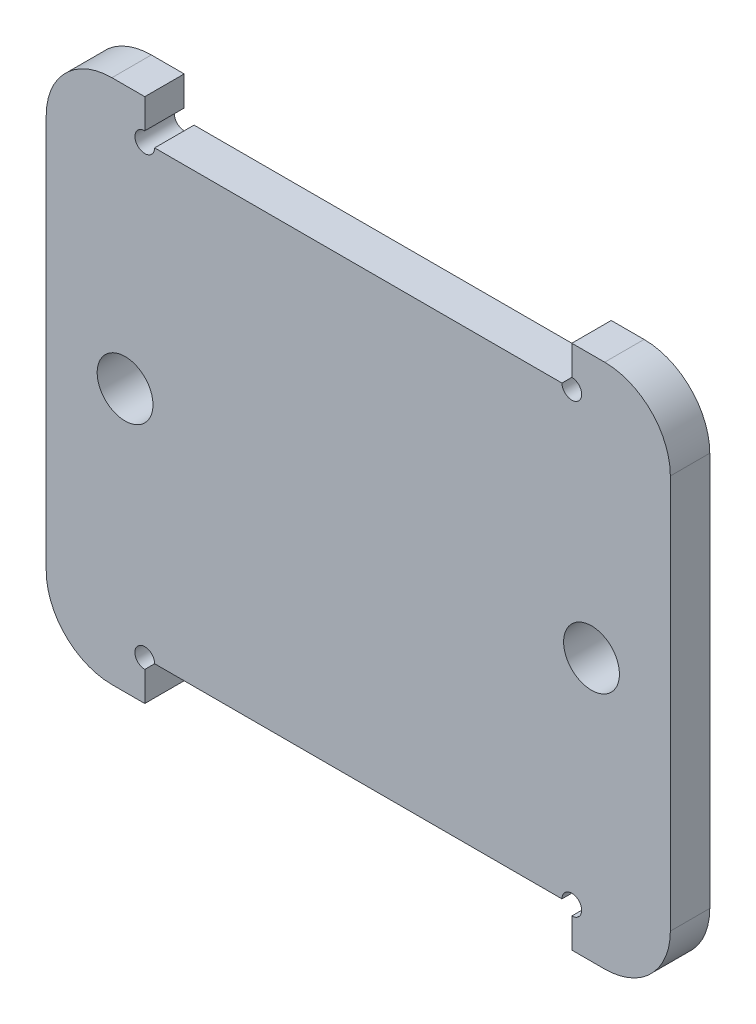
ISO-10303-21;
HEADER;
FILE_DESCRIPTION(('STEP AP214'),'2;1');
FILE_NAME('part.step','',(''),(''),'','','');
FILE_SCHEMA(('AUTOMOTIVE_DESIGN { 1 0 10303 214 1 1 1 1 }'));
ENDSEC;
DATA;
#1=APPLICATION_CONTEXT('core data for automotive mechanical design processes');
#2=APPLICATION_PROTOCOL_DEFINITION('international standard','automotive_design',2000,#1);
#3=PRODUCT_CONTEXT('',#1,'mechanical');
#4=PRODUCT('Part','Part','',(#3));
#5=PRODUCT_RELATED_PRODUCT_CATEGORY('part','',(#4));
#6=PRODUCT_DEFINITION_FORMATION('','',#4);
#7=PRODUCT_DEFINITION_CONTEXT('part definition',#1,'design');
#8=PRODUCT_DEFINITION('design','',#6,#7);
#9=PRODUCT_DEFINITION_SHAPE('','',#8);
#10=(LENGTH_UNIT() NAMED_UNIT(*) SI_UNIT(.MILLI.,.METRE.));
#11=(NAMED_UNIT(*) PLANE_ANGLE_UNIT() SI_UNIT($,.RADIAN.));
#12=(NAMED_UNIT(*) SI_UNIT($,.STERADIAN.) SOLID_ANGLE_UNIT());
#13=UNCERTAINTY_MEASURE_WITH_UNIT(LENGTH_MEASURE(1.E-05),#10,'distance_accuracy_value','');
#14=(GEOMETRIC_REPRESENTATION_CONTEXT(3) GLOBAL_UNCERTAINTY_ASSIGNED_CONTEXT((#13)) GLOBAL_UNIT_ASSIGNED_CONTEXT((#10,
#11,#12)) REPRESENTATION_CONTEXT('',''));
#15=CARTESIAN_POINT('',(0.,0.,0.));
#16=DIRECTION('',(0.,0.,1.));
#17=DIRECTION('',(1.,0.,0.));
#18=AXIS2_PLACEMENT_3D('',#15,#16,#17);
#19=CARTESIAN_POINT('',(-310.,90.,0.));
#20=DIRECTION('',(0.,0.,-1.));
#21=DIRECTION('',(-1.,0.,0.));
#22=AXIS2_PLACEMENT_3D('',#19,#20,#21);
#23=PLANE('',#22);
#24=CARTESIAN_POINT('',(-383.,60.,0.));
#25=DIRECTION('',(0.,0.,-1.));
#26=DIRECTION('',(-1.,0.,0.));
#27=AXIS2_PLACEMENT_3D('',#24,#25,#26);
#28=CIRCLE('',#27,4.24999999999998);
#29=CARTESIAN_POINT('',(-387.25,60.,0.));
#30=VERTEX_POINT('',#29);
#31=EDGE_CURVE('E161',#30,#30,#28,.F.);
#32=ORIENTED_EDGE('',*,*,#31,.T.);
#33=EDGE_LOOP('',(#32));
#34=FACE_BOUND('',#33,.T.);
#35=CARTESIAN_POINT('',(-312.,60.,0.));
#36=DIRECTION('',(0.,0.,-1.));
#37=DIRECTION('',(-1.,0.,0.));
#38=AXIS2_PLACEMENT_3D('',#35,#36,#37);
#39=CIRCLE('',#38,4.24999999999998);
#40=CARTESIAN_POINT('',(-316.25,60.,0.));
#41=VERTEX_POINT('',#40);
#42=EDGE_CURVE('E158',#41,#41,#39,.F.);
#43=ORIENTED_EDGE('',*,*,#42,.T.);
#44=EDGE_LOOP('',(#43));
#45=FACE_BOUND('',#44,.T.);
#46=DIRECTION('',(1.,0.,0.));
#47=VECTOR('',#46,1.);
#48=CARTESIAN_POINT('',(-310.,20.,0.));
#49=LINE('',#48,#47);
#50=CARTESIAN_POINT('',(-310.,20.,0.));
#51=VERTEX_POINT('',#50);
#52=CARTESIAN_POINT('',(-315.,20.,0.));
#53=VERTEX_POINT('',#52);
#54=EDGE_CURVE('E173',#51,#53,#49,.F.);
#55=ORIENTED_EDGE('',*,*,#54,.T.);
#56=DIRECTION('',(0.,1.,0.));
#57=VECTOR('',#56,1.);
#58=CARTESIAN_POINT('',(-315.,20.,0.));
#59=LINE('',#58,#57);
#60=CARTESIAN_POINT('',(-315.,24.4999999999999,0.));
#61=VERTEX_POINT('',#60);
#62=EDGE_CURVE('E167',#53,#61,#59,.T.);
#63=ORIENTED_EDGE('',*,*,#62,.T.);
#64=CARTESIAN_POINT('',(-315.,25.9999999999999,0.));
#65=DIRECTION('',(0.,0.,1.));
#66=DIRECTION('',(1.,0.,0.));
#67=AXIS2_PLACEMENT_3D('',#64,#65,#66);
#68=CIRCLE('',#67,1.5);
#69=CARTESIAN_POINT('',(-316.5,26.,0.));
#70=VERTEX_POINT('',#69);
#71=EDGE_CURVE('E154',#61,#70,#68,.T.);
#72=ORIENTED_EDGE('',*,*,#71,.T.);
#73=DIRECTION('',(-1.,0.,0.));
#74=VECTOR('',#73,1.);
#75=CARTESIAN_POINT('',(-315.,26.,0.));
#76=LINE('',#75,#74);
#77=CARTESIAN_POINT('',(-378.5,25.9999999999999,0.));
#78=VERTEX_POINT('',#77);
#79=EDGE_CURVE('E150',#70,#78,#76,.T.);
#80=ORIENTED_EDGE('',*,*,#79,.T.);
#81=CARTESIAN_POINT('',(-380.,25.9999999999999,0.));
#82=DIRECTION('',(0.,0.,1.));
#83=DIRECTION('',(1.,0.,0.));
#84=AXIS2_PLACEMENT_3D('',#81,#82,#83);
#85=CIRCLE('',#84,1.5);
#86=CARTESIAN_POINT('',(-380.,24.4999999999999,0.));
#87=VERTEX_POINT('',#86);
#88=EDGE_CURVE('E19',#78,#87,#85,.T.);
#89=ORIENTED_EDGE('',*,*,#88,.T.);
#90=DIRECTION('',(0.,1.,0.));
#91=VECTOR('',#90,1.);
#92=CARTESIAN_POINT('',(-380.,20.,0.));
#93=LINE('',#92,#91);
#94=CARTESIAN_POINT('',(-380.,20.,0.));
#95=VERTEX_POINT('',#94);
#96=EDGE_CURVE('E225',#87,#95,#93,.F.);
#97=ORIENTED_EDGE('',*,*,#96,.T.);
#98=DIRECTION('',(-1.,0.,0.));
#99=VECTOR('',#98,1.);
#100=CARTESIAN_POINT('',(-385.,20.,0.));
#101=LINE('',#100,#99);
#102=CARTESIAN_POINT('',(-385.,20.,0.));
#103=VERTEX_POINT('',#102);
#104=EDGE_CURVE('E218',#95,#103,#101,.T.);
#105=ORIENTED_EDGE('',*,*,#104,.T.);
#106=CARTESIAN_POINT('',(-385.,30.,0.));
#107=DIRECTION('',(0.,0.,-1.));
#108=DIRECTION('',(-1.,0.,0.));
#109=AXIS2_PLACEMENT_3D('',#106,#107,#108);
#110=CIRCLE('',#109,9.99999999999995);
#111=CARTESIAN_POINT('',(-395.,30.,0.));
#112=VERTEX_POINT('',#111);
#113=EDGE_CURVE('E221',#112,#103,#110,.F.);
#114=ORIENTED_EDGE('',*,*,#113,.F.);
#115=DIRECTION('',(0.,1.,0.));
#116=VECTOR('',#115,1.);
#117=CARTESIAN_POINT('',(-395.,90.,0.));
#118=LINE('',#117,#116);
#119=CARTESIAN_POINT('',(-395.,90.,0.));
#120=VERTEX_POINT('',#119);
#121=EDGE_CURVE('E213',#112,#120,#118,.T.);
#122=ORIENTED_EDGE('',*,*,#121,.T.);
#123=CARTESIAN_POINT('',(-385.,90.,0.));
#124=DIRECTION('',(0.,0.,-1.));
#125=DIRECTION('',(-1.,0.,0.));
#126=AXIS2_PLACEMENT_3D('',#123,#124,#125);
#127=CIRCLE('',#126,9.99999999999995);
#128=CARTESIAN_POINT('',(-385.,100.,0.));
#129=VERTEX_POINT('',#128);
#130=EDGE_CURVE('E216',#129,#120,#127,.F.);
#131=ORIENTED_EDGE('',*,*,#130,.F.);
#132=DIRECTION('',(1.,0.,0.));
#133=VECTOR('',#132,1.);
#134=CARTESIAN_POINT('',(-380.,100.,0.));
#135=LINE('',#134,#133);
#136=CARTESIAN_POINT('',(-380.,100.,0.));
#137=VERTEX_POINT('',#136);
#138=EDGE_CURVE('E207',#129,#137,#135,.T.);
#139=ORIENTED_EDGE('',*,*,#138,.T.);
#140=DIRECTION('',(0.,1.,0.));
#141=VECTOR('',#140,1.);
#142=CARTESIAN_POINT('',(-380.,94.,0.));
#143=LINE('',#142,#141);
#144=CARTESIAN_POINT('',(-380.,95.4999999999999,0.));
#145=VERTEX_POINT('',#144);
#146=EDGE_CURVE('E201',#137,#145,#143,.F.);
#147=ORIENTED_EDGE('',*,*,#146,.T.);
#148=CARTESIAN_POINT('',(-380.,93.9999999999999,0.));
#149=DIRECTION('',(0.,0.,1.));
#150=DIRECTION('',(1.,0.,0.));
#151=AXIS2_PLACEMENT_3D('',#148,#149,#150);
#152=CIRCLE('',#151,1.5);
#153=CARTESIAN_POINT('',(-378.5,94.,0.));
#154=VERTEX_POINT('',#153);
#155=EDGE_CURVE('E271',#145,#154,#152,.T.);
#156=ORIENTED_EDGE('',*,*,#155,.T.);
#157=DIRECTION('',(1.,0.,0.));
#158=VECTOR('',#157,1.);
#159=CARTESIAN_POINT('',(-380.,94.,0.));
#160=LINE('',#159,#158);
#161=CARTESIAN_POINT('',(-316.5,94.,0.));
#162=VERTEX_POINT('',#161);
#163=EDGE_CURVE('E196',#154,#162,#160,.T.);
#164=ORIENTED_EDGE('',*,*,#163,.T.);
#165=CARTESIAN_POINT('',(-315.,93.9999999999999,0.));
#166=DIRECTION('',(0.,0.,1.));
#167=DIRECTION('',(1.,0.,0.));
#168=AXIS2_PLACEMENT_3D('',#165,#166,#167);
#169=CIRCLE('',#168,1.5);
#170=CARTESIAN_POINT('',(-315.,95.4999999999999,0.));
#171=VERTEX_POINT('',#170);
#172=EDGE_CURVE('E269',#162,#171,#169,.T.);
#173=ORIENTED_EDGE('',*,*,#172,.T.);
#174=DIRECTION('',(0.,1.,0.));
#175=VECTOR('',#174,1.);
#176=CARTESIAN_POINT('',(-315.,94.,0.));
#177=LINE('',#176,#175);
#178=CARTESIAN_POINT('',(-315.,100.,0.));
#179=VERTEX_POINT('',#178);
#180=EDGE_CURVE('E190',#171,#179,#177,.T.);
#181=ORIENTED_EDGE('',*,*,#180,.T.);
#182=DIRECTION('',(1.,0.,0.));
#183=VECTOR('',#182,1.);
#184=CARTESIAN_POINT('',(-315.,100.,0.));
#185=LINE('',#184,#183);
#186=CARTESIAN_POINT('',(-310.,99.9999999999999,0.));
#187=VERTEX_POINT('',#186);
#188=EDGE_CURVE('E183',#179,#187,#185,.T.);
#189=ORIENTED_EDGE('',*,*,#188,.T.);
#190=CARTESIAN_POINT('',(-310.,90.,0.));
#191=DIRECTION('',(0.,0.,-1.));
#192=DIRECTION('',(-1.,0.,0.));
#193=AXIS2_PLACEMENT_3D('',#190,#191,#192);
#194=CIRCLE('',#193,9.99999999999995);
#195=CARTESIAN_POINT('',(-300.,90.,0.));
#196=VERTEX_POINT('',#195);
#197=EDGE_CURVE('E186',#196,#187,#194,.F.);
#198=ORIENTED_EDGE('',*,*,#197,.F.);
#199=DIRECTION('',(0.,1.,0.));
#200=VECTOR('',#199,1.);
#201=CARTESIAN_POINT('',(-300.,90.,0.));
#202=LINE('',#201,#200);
#203=CARTESIAN_POINT('',(-300.,30.,0.));
#204=VERTEX_POINT('',#203);
#205=EDGE_CURVE('E178',#196,#204,#202,.F.);
#206=ORIENTED_EDGE('',*,*,#205,.T.);
#207=CARTESIAN_POINT('',(-310.,30.,0.));
#208=DIRECTION('',(0.,0.,-1.));
#209=DIRECTION('',(-1.,0.,0.));
#210=AXIS2_PLACEMENT_3D('',#207,#208,#209);
#211=CIRCLE('',#210,9.99999999999995);
#212=EDGE_CURVE('E181',#51,#204,#211,.F.);
#213=ORIENTED_EDGE('',*,*,#212,.F.);
#214=EDGE_LOOP('',(#55,#63,#72,#80,#89,#97,#105,#114,#122,#131,#139,#147,#156,#164,#173,#181,
#189,#198,#206,#213));
#215=FACE_BOUND('',#214,.T.);
#216=ADVANCED_FACE('F16',(#34,#45,#215),#23,.T.);
#217=CARTESIAN_POINT('',(-380.,25.9999999999999,0.));
#218=DIRECTION('',(0.,0.,1.));
#219=DIRECTION('',(1.,0.,0.));
#220=AXIS2_PLACEMENT_3D('',#217,#218,#219);
#221=CYLINDRICAL_SURFACE('',#220,1.5);
#222=DIRECTION('',(0.,0.,1.));
#223=VECTOR('',#222,1.);
#224=CARTESIAN_POINT('',(-378.5,25.9999999999999,6.00000000000001));
#225=LINE('',#224,#223);
#226=CARTESIAN_POINT('',(-378.5,26.,6.00000000000001));
#227=VERTEX_POINT('',#226);
#228=EDGE_CURVE('E140',#78,#227,#225,.T.);
#229=ORIENTED_EDGE('',*,*,#228,.T.);
#230=CARTESIAN_POINT('',(-380.,25.9999999999999,6.00000000000001));
#231=DIRECTION('',(0.,0.,1.));
#232=DIRECTION('',(1.,0.,0.));
#233=AXIS2_PLACEMENT_3D('',#230,#231,#232);
#234=CIRCLE('',#233,1.5);
#235=CARTESIAN_POINT('',(-380.,24.4999999999999,6.00000000000001));
#236=VERTEX_POINT('',#235);
#237=EDGE_CURVE('E259',#227,#236,#234,.T.);
#238=ORIENTED_EDGE('',*,*,#237,.T.);
#239=DIRECTION('',(0.,0.,1.));
#240=VECTOR('',#239,1.);
#241=CARTESIAN_POINT('',(-380.,24.4999999999999,6.00000000000001));
#242=LINE('',#241,#240);
#243=EDGE_CURVE('E142',#236,#87,#242,.F.);
#244=ORIENTED_EDGE('',*,*,#243,.T.);
#245=ORIENTED_EDGE('',*,*,#88,.F.);
#246=EDGE_LOOP('',(#229,#238,#244,#245));
#247=FACE_BOUND('',#246,.T.);
#248=ADVANCED_FACE('F138',(#247),#221,.F.);
#249=CARTESIAN_POINT('',(-380.,20.,6.00000000000001));
#250=DIRECTION('',(-1.,0.,0.));
#251=DIRECTION('',(0.,0.,1.));
#252=AXIS2_PLACEMENT_3D('',#249,#250,#251);
#253=PLANE('',#252);
#254=ORIENTED_EDGE('',*,*,#243,.F.);
#255=DIRECTION('',(0.,1.,0.));
#256=VECTOR('',#255,1.);
#257=CARTESIAN_POINT('',(-380.,90.,6.00000000000001));
#258=LINE('',#257,#256);
#259=CARTESIAN_POINT('',(-380.,20.,6.00000000000001));
#260=VERTEX_POINT('',#259);
#261=EDGE_CURVE('E261',#236,#260,#258,.F.);
#262=ORIENTED_EDGE('',*,*,#261,.T.);
#263=DIRECTION('',(0.,0.,1.));
#264=VECTOR('',#263,1.);
#265=CARTESIAN_POINT('',(-380.,20.,6.00000000000001));
#266=LINE('',#265,#264);
#267=EDGE_CURVE('E222',#260,#95,#266,.F.);
#268=ORIENTED_EDGE('',*,*,#267,.T.);
#269=ORIENTED_EDGE('',*,*,#96,.F.);
#270=EDGE_LOOP('',(#254,#262,#268,#269));
#271=FACE_BOUND('',#270,.T.);
#272=ADVANCED_FACE('F288',(#271),#253,.F.);
#273=CARTESIAN_POINT('',(-385.,20.,6.00000000000001));
#274=DIRECTION('',(0.,1.,0.));
#275=DIRECTION('',(-1.,0.,0.));
#276=AXIS2_PLACEMENT_3D('',#273,#274,#275);
#277=PLANE('',#276);
#278=ORIENTED_EDGE('',*,*,#267,.F.);
#279=DIRECTION('',(-1.,0.,0.));
#280=VECTOR('',#279,1.);
#281=CARTESIAN_POINT('',(-310.,20.,6.00000000000001));
#282=LINE('',#281,#280);
#283=CARTESIAN_POINT('',(-385.,20.,6.00000000000001));
#284=VERTEX_POINT('',#283);
#285=EDGE_CURVE('E258',#260,#284,#282,.T.);
#286=ORIENTED_EDGE('',*,*,#285,.T.);
#287=DIRECTION('',(0.,0.,-1.));
#288=VECTOR('',#287,1.);
#289=CARTESIAN_POINT('',(-385.,20.,6.00000000000001));
#290=LINE('',#289,#288);
#291=EDGE_CURVE('E274',#103,#284,#290,.F.);
#292=ORIENTED_EDGE('',*,*,#291,.F.);
#293=ORIENTED_EDGE('',*,*,#104,.F.);
#294=EDGE_LOOP('',(#278,#286,#292,#293));
#295=FACE_BOUND('',#294,.T.);
#296=ADVANCED_FACE('F294',(#295),#277,.F.);
#297=CARTESIAN_POINT('',(-385.,30.,6.00000000000001));
#298=DIRECTION('',(0.,0.,-1.));
#299=DIRECTION('',(-1.,0.,0.));
#300=AXIS2_PLACEMENT_3D('',#297,#298,#299);
#301=CYLINDRICAL_SURFACE('',#300,9.99999999999995);
#302=CARTESIAN_POINT('',(-385.,30.,6.00000000000001));
#303=DIRECTION('',(0.,0.,-1.));
#304=DIRECTION('',(-1.,0.,0.));
#305=AXIS2_PLACEMENT_3D('',#302,#303,#304);
#306=CIRCLE('',#305,9.99999999999995);
#307=CARTESIAN_POINT('',(-395.,30.,6.00000000000001));
#308=VERTEX_POINT('',#307);
#309=EDGE_CURVE('E255',#284,#308,#306,.T.);
#310=ORIENTED_EDGE('',*,*,#309,.T.);
#311=DIRECTION('',(0.,0.,-1.));
#312=VECTOR('',#311,1.);
#313=CARTESIAN_POINT('',(-395.,30.,6.00000000000001));
#314=LINE('',#313,#312);
#315=EDGE_CURVE('E217',#308,#112,#314,.T.);
#316=ORIENTED_EDGE('',*,*,#315,.T.);
#317=ORIENTED_EDGE('',*,*,#113,.T.);
#318=ORIENTED_EDGE('',*,*,#291,.T.);
#319=EDGE_LOOP('',(#310,#316,#317,#318));
#320=FACE_BOUND('',#319,.T.);
#321=ADVANCED_FACE('F347',(#320),#301,.T.);
#322=CARTESIAN_POINT('',(-395.,90.,6.00000000000001));
#323=DIRECTION('',(1.,0.,0.));
#324=DIRECTION('',(0.,0.,-1.));
#325=AXIS2_PLACEMENT_3D('',#322,#323,#324);
#326=PLANE('',#325);
#327=ORIENTED_EDGE('',*,*,#315,.F.);
#328=DIRECTION('',(0.,1.,0.));
#329=VECTOR('',#328,1.);
#330=CARTESIAN_POINT('',(-395.,90.,6.00000000000001));
#331=LINE('',#330,#329);
#332=CARTESIAN_POINT('',(-395.,90.,6.00000000000001));
#333=VERTEX_POINT('',#332);
#334=EDGE_CURVE('E254',#308,#333,#331,.T.);
#335=ORIENTED_EDGE('',*,*,#334,.T.);
#336=DIRECTION('',(0.,0.,-1.));
#337=VECTOR('',#336,1.);
#338=CARTESIAN_POINT('',(-395.,90.,6.00000000000001));
#339=LINE('',#338,#337);
#340=EDGE_CURVE('E273',#120,#333,#339,.F.);
#341=ORIENTED_EDGE('',*,*,#340,.F.);
#342=ORIENTED_EDGE('',*,*,#121,.F.);
#343=EDGE_LOOP('',(#327,#335,#341,#342));
#344=FACE_BOUND('',#343,.T.);
#345=ADVANCED_FACE('F346',(#344),#326,.F.);
#346=CARTESIAN_POINT('',(-385.,90.,6.00000000000001));
#347=DIRECTION('',(0.,0.,-1.));
#348=DIRECTION('',(-1.,0.,0.));
#349=AXIS2_PLACEMENT_3D('',#346,#347,#348);
#350=CYLINDRICAL_SURFACE('',#349,9.99999999999995);
#351=CARTESIAN_POINT('',(-385.,90.,6.00000000000001));
#352=DIRECTION('',(0.,0.,-1.));
#353=DIRECTION('',(-1.,0.,0.));
#354=AXIS2_PLACEMENT_3D('',#351,#352,#353);
#355=CIRCLE('',#354,9.99999999999995);
#356=CARTESIAN_POINT('',(-385.,100.,6.00000000000001));
#357=VERTEX_POINT('',#356);
#358=EDGE_CURVE('E250',#333,#357,#355,.T.);
#359=ORIENTED_EDGE('',*,*,#358,.T.);
#360=DIRECTION('',(0.,0.,-1.));
#361=VECTOR('',#360,1.);
#362=CARTESIAN_POINT('',(-385.,100.,6.00000000000001));
#363=LINE('',#362,#361);
#364=EDGE_CURVE('E210',#357,#129,#363,.T.);
#365=ORIENTED_EDGE('',*,*,#364,.T.);
#366=ORIENTED_EDGE('',*,*,#130,.T.);
#367=ORIENTED_EDGE('',*,*,#340,.T.);
#368=EDGE_LOOP('',(#359,#365,#366,#367));
#369=FACE_BOUND('',#368,.T.);
#370=ADVANCED_FACE('F339',(#369),#350,.T.);
#371=CARTESIAN_POINT('',(-380.,100.,6.00000000000001));
#372=DIRECTION('',(0.,-1.,0.));
#373=DIRECTION('',(0.,0.,-1.));
#374=AXIS2_PLACEMENT_3D('',#371,#372,#373);
#375=PLANE('',#374);
#376=ORIENTED_EDGE('',*,*,#364,.F.);
#377=DIRECTION('',(-1.,0.,0.));
#378=VECTOR('',#377,1.);
#379=CARTESIAN_POINT('',(-310.,100.,6.00000000000001));
#380=LINE('',#379,#378);
#381=CARTESIAN_POINT('',(-380.,100.,6.00000000000001));
#382=VERTEX_POINT('',#381);
#383=EDGE_CURVE('E253',#357,#382,#380,.F.);
#384=ORIENTED_EDGE('',*,*,#383,.T.);
#385=DIRECTION('',(0.,0.,1.));
#386=VECTOR('',#385,1.);
#387=CARTESIAN_POINT('',(-380.,100.,6.00000000000001));
#388=LINE('',#387,#386);
#389=EDGE_CURVE('E204',#382,#137,#388,.F.);
#390=ORIENTED_EDGE('',*,*,#389,.T.);
#391=ORIENTED_EDGE('',*,*,#138,.F.);
#392=EDGE_LOOP('',(#376,#384,#390,#391));
#393=FACE_BOUND('',#392,.T.);
#394=ADVANCED_FACE('F421',(#393),#375,.F.);
#395=CARTESIAN_POINT('',(-380.,94.,6.00000000000001));
#396=DIRECTION('',(-1.,0.,0.));
#397=DIRECTION('',(0.,0.,1.));
#398=AXIS2_PLACEMENT_3D('',#395,#396,#397);
#399=PLANE('',#398);
#400=DIRECTION('',(0.,0.,1.));
#401=VECTOR('',#400,1.);
#402=CARTESIAN_POINT('',(-380.,95.4999999999999,0.));
#403=LINE('',#402,#401);
#404=CARTESIAN_POINT('',(-380.,95.4999999999999,6.00000000000001));
#405=VERTEX_POINT('',#404);
#406=EDGE_CURVE('E203',#405,#145,#403,.F.);
#407=ORIENTED_EDGE('',*,*,#406,.T.);
#408=ORIENTED_EDGE('',*,*,#146,.F.);
#409=ORIENTED_EDGE('',*,*,#389,.F.);
#410=DIRECTION('',(0.,1.,0.));
#411=VECTOR('',#410,1.);
#412=CARTESIAN_POINT('',(-380.,90.,6.00000000000001));
#413=LINE('',#412,#411);
#414=EDGE_CURVE('E249',#382,#405,#413,.F.);
#415=ORIENTED_EDGE('',*,*,#414,.T.);
#416=EDGE_LOOP('',(#407,#408,#409,#415));
#417=FACE_BOUND('',#416,.T.);
#418=ADVANCED_FACE('F417',(#417),#399,.F.);
#419=CARTESIAN_POINT('',(-380.,93.9999999999999,0.));
#420=DIRECTION('',(0.,0.,1.));
#421=DIRECTION('',(1.,0.,0.));
#422=AXIS2_PLACEMENT_3D('',#419,#420,#421);
#423=CYLINDRICAL_SURFACE('',#422,1.5);
#424=ORIENTED_EDGE('',*,*,#406,.F.);
#425=CARTESIAN_POINT('',(-380.,93.9999999999999,6.00000000000001));
#426=DIRECTION('',(0.,0.,1.));
#427=DIRECTION('',(1.,0.,0.));
#428=AXIS2_PLACEMENT_3D('',#425,#426,#427);
#429=CIRCLE('',#428,1.5);
#430=CARTESIAN_POINT('',(-378.5,94.,6.00000000000001));
#431=VERTEX_POINT('',#430);
#432=EDGE_CURVE('E246',#405,#431,#429,.T.);
#433=ORIENTED_EDGE('',*,*,#432,.T.);
#434=DIRECTION('',(0.,0.,-1.));
#435=VECTOR('',#434,1.);
#436=CARTESIAN_POINT('',(-378.5,94.,6.00000000000001));
#437=LINE('',#436,#435);
#438=EDGE_CURVE('E200',#431,#154,#437,.T.);
#439=ORIENTED_EDGE('',*,*,#438,.T.);
#440=ORIENTED_EDGE('',*,*,#155,.F.);
#441=EDGE_LOOP('',(#424,#433,#439,#440));
#442=FACE_BOUND('',#441,.T.);
#443=ADVANCED_FACE('F413',(#442),#423,.F.);
#444=CARTESIAN_POINT('',(-380.,94.,6.00000000000001));
#445=DIRECTION('',(0.,-1.,0.));
#446=DIRECTION('',(0.,0.,-1.));
#447=AXIS2_PLACEMENT_3D('',#444,#445,#446);
#448=PLANE('',#447);
#449=ORIENTED_EDGE('',*,*,#438,.F.);
#450=DIRECTION('',(-1.,0.,0.));
#451=VECTOR('',#450,1.);
#452=CARTESIAN_POINT('',(-310.,94.,6.00000000000001));
#453=LINE('',#452,#451);
#454=CARTESIAN_POINT('',(-316.5,94.,6.00000000000001));
#455=VERTEX_POINT('',#454);
#456=EDGE_CURVE('E245',#431,#455,#453,.F.);
#457=ORIENTED_EDGE('',*,*,#456,.T.);
#458=DIRECTION('',(0.,0.,1.));
#459=VECTOR('',#458,1.);
#460=CARTESIAN_POINT('',(-316.5,94.,0.));
#461=LINE('',#460,#459);
#462=EDGE_CURVE('E199',#455,#162,#461,.F.);
#463=ORIENTED_EDGE('',*,*,#462,.T.);
#464=ORIENTED_EDGE('',*,*,#163,.F.);
#465=EDGE_LOOP('',(#449,#457,#463,#464));
#466=FACE_BOUND('',#465,.T.);
#467=ADVANCED_FACE('F409',(#466),#448,.F.);
#468=CARTESIAN_POINT('',(-315.,93.9999999999999,0.));
#469=DIRECTION('',(0.,0.,1.));
#470=DIRECTION('',(1.,0.,0.));
#471=AXIS2_PLACEMENT_3D('',#468,#469,#470);
#472=CYLINDRICAL_SURFACE('',#471,1.5);
#473=ORIENTED_EDGE('',*,*,#172,.F.);
#474=ORIENTED_EDGE('',*,*,#462,.F.);
#475=CARTESIAN_POINT('',(-315.,93.9999999999999,6.00000000000001));
#476=DIRECTION('',(0.,0.,1.));
#477=DIRECTION('',(1.,0.,0.));
#478=AXIS2_PLACEMENT_3D('',#475,#476,#477);
#479=CIRCLE('',#478,1.5);
#480=CARTESIAN_POINT('',(-315.,95.4999999999999,6.00000000000001));
#481=VERTEX_POINT('',#480);
#482=EDGE_CURVE('E242',#455,#481,#479,.T.);
#483=ORIENTED_EDGE('',*,*,#482,.T.);
#484=DIRECTION('',(0.,0.,-1.));
#485=VECTOR('',#484,1.);
#486=CARTESIAN_POINT('',(-315.,95.5,6.00000000000001));
#487=LINE('',#486,#485);
#488=EDGE_CURVE('E193',#481,#171,#487,.T.);
#489=ORIENTED_EDGE('',*,*,#488,.T.);
#490=EDGE_LOOP('',(#473,#474,#483,#489));
#491=FACE_BOUND('',#490,.T.);
#492=ADVANCED_FACE('F405',(#491),#472,.F.);
#493=CARTESIAN_POINT('',(-315.,94.,6.00000000000001));
#494=DIRECTION('',(1.,0.,0.));
#495=DIRECTION('',(0.,0.,-1.));
#496=AXIS2_PLACEMENT_3D('',#493,#494,#495);
#497=PLANE('',#496);
#498=ORIENTED_EDGE('',*,*,#488,.F.);
#499=DIRECTION('',(0.,1.,0.));
#500=VECTOR('',#499,1.);
#501=CARTESIAN_POINT('',(-315.,90.,6.00000000000001));
#502=LINE('',#501,#500);
#503=CARTESIAN_POINT('',(-315.,100.,6.00000000000001));
#504=VERTEX_POINT('',#503);
#505=EDGE_CURVE('E244',#481,#504,#502,.T.);
#506=ORIENTED_EDGE('',*,*,#505,.T.);
#507=DIRECTION('',(0.,0.,-1.));
#508=VECTOR('',#507,1.);
#509=CARTESIAN_POINT('',(-315.,100.,6.00000000000001));
#510=LINE('',#509,#508);
#511=EDGE_CURVE('E187',#504,#179,#510,.T.);
#512=ORIENTED_EDGE('',*,*,#511,.T.);
#513=ORIENTED_EDGE('',*,*,#180,.F.);
#514=EDGE_LOOP('',(#498,#506,#512,#513));
#515=FACE_BOUND('',#514,.T.);
#516=ADVANCED_FACE('F401',(#515),#497,.F.);
#517=CARTESIAN_POINT('',(-315.,100.,6.00000000000001));
#518=DIRECTION('',(0.,-1.,0.));
#519=DIRECTION('',(0.,0.,-1.));
#520=AXIS2_PLACEMENT_3D('',#517,#518,#519);
#521=PLANE('',#520);
#522=ORIENTED_EDGE('',*,*,#511,.F.);
#523=DIRECTION('',(-1.,0.,0.));
#524=VECTOR('',#523,1.);
#525=CARTESIAN_POINT('',(-310.,100.,6.00000000000001));
#526=LINE('',#525,#524);
#527=CARTESIAN_POINT('',(-310.,99.9999999999999,6.00000000000001));
#528=VERTEX_POINT('',#527);
#529=EDGE_CURVE('E241',#504,#528,#526,.F.);
#530=ORIENTED_EDGE('',*,*,#529,.T.);
#531=DIRECTION('',(0.,0.,-1.));
#532=VECTOR('',#531,1.);
#533=CARTESIAN_POINT('',(-310.,99.9999999999999,6.00000000000001));
#534=LINE('',#533,#532);
#535=EDGE_CURVE('E268',#187,#528,#534,.F.);
#536=ORIENTED_EDGE('',*,*,#535,.F.);
#537=ORIENTED_EDGE('',*,*,#188,.F.);
#538=EDGE_LOOP('',(#522,#530,#536,#537));
#539=FACE_BOUND('',#538,.T.);
#540=ADVANCED_FACE('F397',(#539),#521,.F.);
#541=CARTESIAN_POINT('',(-310.,90.,6.00000000000001));
#542=DIRECTION('',(0.,0.,-1.));
#543=DIRECTION('',(-1.,0.,0.));
#544=AXIS2_PLACEMENT_3D('',#541,#542,#543);
#545=CYLINDRICAL_SURFACE('',#544,9.99999999999995);
#546=CARTESIAN_POINT('',(-310.,90.,6.00000000000001));
#547=DIRECTION('',(0.,0.,-1.));
#548=DIRECTION('',(-1.,0.,0.));
#549=AXIS2_PLACEMENT_3D('',#546,#547,#548);
#550=CIRCLE('',#549,9.99999999999995);
#551=CARTESIAN_POINT('',(-300.,90.,6.00000000000001));
#552=VERTEX_POINT('',#551);
#553=EDGE_CURVE('E238',#528,#552,#550,.T.);
#554=ORIENTED_EDGE('',*,*,#553,.T.);
#555=DIRECTION('',(0.,0.,1.));
#556=VECTOR('',#555,1.);
#557=CARTESIAN_POINT('',(-300.,90.,6.00000000000001));
#558=LINE('',#557,#556);
#559=EDGE_CURVE('E182',#552,#196,#558,.F.);
#560=ORIENTED_EDGE('',*,*,#559,.T.);
#561=ORIENTED_EDGE('',*,*,#197,.T.);
#562=ORIENTED_EDGE('',*,*,#535,.T.);
#563=EDGE_LOOP('',(#554,#560,#561,#562));
#564=FACE_BOUND('',#563,.T.);
#565=ADVANCED_FACE('F393',(#564),#545,.T.);
#566=CARTESIAN_POINT('',(-300.,90.,6.00000000000001));
#567=DIRECTION('',(-1.,0.,0.));
#568=DIRECTION('',(0.,0.,1.));
#569=AXIS2_PLACEMENT_3D('',#566,#567,#568);
#570=PLANE('',#569);
#571=ORIENTED_EDGE('',*,*,#559,.F.);
#572=DIRECTION('',(0.,1.,0.));
#573=VECTOR('',#572,1.);
#574=CARTESIAN_POINT('',(-300.,90.,6.00000000000001));
#575=LINE('',#574,#573);
#576=CARTESIAN_POINT('',(-300.,30.,6.00000000000001));
#577=VERTEX_POINT('',#576);
#578=EDGE_CURVE('E237',#552,#577,#575,.F.);
#579=ORIENTED_EDGE('',*,*,#578,.T.);
#580=DIRECTION('',(0.,0.,-1.));
#581=VECTOR('',#580,1.);
#582=CARTESIAN_POINT('',(-300.,30.,6.00000000000001));
#583=LINE('',#582,#581);
#584=EDGE_CURVE('E266',#204,#577,#583,.F.);
#585=ORIENTED_EDGE('',*,*,#584,.F.);
#586=ORIENTED_EDGE('',*,*,#205,.F.);
#587=EDGE_LOOP('',(#571,#579,#585,#586));
#588=FACE_BOUND('',#587,.T.);
#589=ADVANCED_FACE('F389',(#588),#570,.F.);
#590=CARTESIAN_POINT('',(-310.,30.,6.00000000000001));
#591=DIRECTION('',(0.,0.,-1.));
#592=DIRECTION('',(-1.,0.,0.));
#593=AXIS2_PLACEMENT_3D('',#590,#591,#592);
#594=CYLINDRICAL_SURFACE('',#593,9.99999999999995);
#595=CARTESIAN_POINT('',(-310.,30.,6.00000000000001));
#596=DIRECTION('',(0.,0.,-1.));
#597=DIRECTION('',(-1.,0.,0.));
#598=AXIS2_PLACEMENT_3D('',#595,#596,#597);
#599=CIRCLE('',#598,9.99999999999995);
#600=CARTESIAN_POINT('',(-310.,20.,6.00000000000001));
#601=VERTEX_POINT('',#600);
#602=EDGE_CURVE('E233',#577,#601,#599,.T.);
#603=ORIENTED_EDGE('',*,*,#602,.T.);
#604=DIRECTION('',(0.,0.,1.));
#605=VECTOR('',#604,1.);
#606=CARTESIAN_POINT('',(-310.,20.,6.00000000000001));
#607=LINE('',#606,#605);
#608=EDGE_CURVE('E175',#601,#51,#607,.F.);
#609=ORIENTED_EDGE('',*,*,#608,.T.);
#610=ORIENTED_EDGE('',*,*,#212,.T.);
#611=ORIENTED_EDGE('',*,*,#584,.T.);
#612=EDGE_LOOP('',(#603,#609,#610,#611));
#613=FACE_BOUND('',#612,.T.);
#614=ADVANCED_FACE('F385',(#613),#594,.T.);
#615=CARTESIAN_POINT('',(-310.,20.,6.00000000000001));
#616=DIRECTION('',(0.,1.,0.));
#617=DIRECTION('',(0.,0.,1.));
#618=AXIS2_PLACEMENT_3D('',#615,#616,#617);
#619=PLANE('',#618);
#620=ORIENTED_EDGE('',*,*,#608,.F.);
#621=DIRECTION('',(-1.,0.,0.));
#622=VECTOR('',#621,1.);
#623=CARTESIAN_POINT('',(-310.,20.,6.00000000000001));
#624=LINE('',#623,#622);
#625=CARTESIAN_POINT('',(-315.,20.,6.00000000000001));
#626=VERTEX_POINT('',#625);
#627=EDGE_CURVE('E236',#601,#626,#624,.T.);
#628=ORIENTED_EDGE('',*,*,#627,.T.);
#629=DIRECTION('',(0.,0.,-1.));
#630=VECTOR('',#629,1.);
#631=CARTESIAN_POINT('',(-315.,20.,6.00000000000001));
#632=LINE('',#631,#630);
#633=EDGE_CURVE('E170',#626,#53,#632,.T.);
#634=ORIENTED_EDGE('',*,*,#633,.T.);
#635=ORIENTED_EDGE('',*,*,#54,.F.);
#636=EDGE_LOOP('',(#620,#628,#634,#635));
#637=FACE_BOUND('',#636,.T.);
#638=ADVANCED_FACE('F381',(#637),#619,.F.);
#639=CARTESIAN_POINT('',(-315.,20.,6.00000000000001));
#640=DIRECTION('',(1.,0.,0.));
#641=DIRECTION('',(0.,0.,-1.));
#642=AXIS2_PLACEMENT_3D('',#639,#640,#641);
#643=PLANE('',#642);
#644=DIRECTION('',(0.,0.,1.));
#645=VECTOR('',#644,1.);
#646=CARTESIAN_POINT('',(-315.,24.4999999999999,0.));
#647=LINE('',#646,#645);
#648=CARTESIAN_POINT('',(-315.,24.4999999999999,6.00000000000001));
#649=VERTEX_POINT('',#648);
#650=EDGE_CURVE('E169',#649,#61,#647,.F.);
#651=ORIENTED_EDGE('',*,*,#650,.T.);
#652=ORIENTED_EDGE('',*,*,#62,.F.);
#653=ORIENTED_EDGE('',*,*,#633,.F.);
#654=DIRECTION('',(0.,1.,0.));
#655=VECTOR('',#654,1.);
#656=CARTESIAN_POINT('',(-315.,90.,6.00000000000001));
#657=LINE('',#656,#655);
#658=EDGE_CURVE('E232',#626,#649,#657,.T.);
#659=ORIENTED_EDGE('',*,*,#658,.T.);
#660=EDGE_LOOP('',(#651,#652,#653,#659));
#661=FACE_BOUND('',#660,.T.);
#662=ADVANCED_FACE('F378',(#661),#643,.F.);
#663=CARTESIAN_POINT('',(-315.,25.9999999999999,0.));
#664=DIRECTION('',(0.,0.,1.));
#665=DIRECTION('',(1.,0.,0.));
#666=AXIS2_PLACEMENT_3D('',#663,#664,#665);
#667=CYLINDRICAL_SURFACE('',#666,1.5);
#668=ORIENTED_EDGE('',*,*,#71,.F.);
#669=ORIENTED_EDGE('',*,*,#650,.F.);
#670=CARTESIAN_POINT('',(-315.,25.9999999999999,6.00000000000001));
#671=DIRECTION('',(0.,0.,1.));
#672=DIRECTION('',(1.,0.,0.));
#673=AXIS2_PLACEMENT_3D('',#670,#671,#672);
#674=CIRCLE('',#673,1.5);
#675=CARTESIAN_POINT('',(-316.5,26.,6.00000000000001));
#676=VERTEX_POINT('',#675);
#677=EDGE_CURVE('E34',#649,#676,#674,.T.);
#678=ORIENTED_EDGE('',*,*,#677,.T.);
#679=DIRECTION('',(0.,0.,1.));
#680=VECTOR('',#679,1.);
#681=CARTESIAN_POINT('',(-316.5,26.,6.00000000000001));
#682=LINE('',#681,#680);
#683=EDGE_CURVE('E153',#676,#70,#682,.F.);
#684=ORIENTED_EDGE('',*,*,#683,.T.);
#685=EDGE_LOOP('',(#668,#669,#678,#684));
#686=FACE_BOUND('',#685,.T.);
#687=ADVANCED_FACE('F375',(#686),#667,.F.);
#688=CARTESIAN_POINT('',(-315.,26.,6.00000000000001));
#689=DIRECTION('',(0.,1.,0.));
#690=DIRECTION('',(-1.,0.,0.));
#691=AXIS2_PLACEMENT_3D('',#688,#689,#690);
#692=PLANE('',#691);
#693=ORIENTED_EDGE('',*,*,#683,.F.);
#694=DIRECTION('',(-1.,0.,0.));
#695=VECTOR('',#694,1.);
#696=CARTESIAN_POINT('',(-310.,26.,6.00000000000001));
#697=LINE('',#696,#695);
#698=EDGE_CURVE('E152',#676,#227,#697,.T.);
#699=ORIENTED_EDGE('',*,*,#698,.T.);
#700=ORIENTED_EDGE('',*,*,#228,.F.);
#701=ORIENTED_EDGE('',*,*,#79,.F.);
#702=EDGE_LOOP('',(#693,#699,#700,#701));
#703=FACE_BOUND('',#702,.T.);
#704=ADVANCED_FACE('F149',(#703),#692,.F.);
#705=CARTESIAN_POINT('',(-312.,60.,6.00000000000001));
#706=DIRECTION('',(0.,0.,-1.));
#707=DIRECTION('',(-1.,0.,0.));
#708=AXIS2_PLACEMENT_3D('',#705,#706,#707);
#709=CYLINDRICAL_SURFACE('',#708,4.24999999999998);
#710=ORIENTED_EDGE('',*,*,#42,.F.);
#711=EDGE_LOOP('',(#710));
#712=FACE_BOUND('',#711,.T.);
#713=CARTESIAN_POINT('',(-312.,60.,6.00000000000001));
#714=DIRECTION('',(0.,0.,-1.));
#715=DIRECTION('',(-1.,0.,0.));
#716=AXIS2_PLACEMENT_3D('',#713,#714,#715);
#717=CIRCLE('',#716,4.24999999999998);
#718=CARTESIAN_POINT('',(-316.25,60.,6.00000000000001));
#719=VERTEX_POINT('',#718);
#720=EDGE_CURVE('E25',#719,#719,#717,.F.);
#721=ORIENTED_EDGE('',*,*,#720,.T.);
#722=EDGE_LOOP('',(#721));
#723=FACE_BOUND('',#722,.T.);
#724=ADVANCED_FACE('F364',(#712,#723),#709,.F.);
#725=CARTESIAN_POINT('',(-383.,60.,6.00000000000001));
#726=DIRECTION('',(0.,0.,-1.));
#727=DIRECTION('',(-1.,0.,0.));
#728=AXIS2_PLACEMENT_3D('',#725,#726,#727);
#729=CYLINDRICAL_SURFACE('',#728,4.24999999999998);
#730=ORIENTED_EDGE('',*,*,#31,.F.);
#731=EDGE_LOOP('',(#730));
#732=FACE_BOUND('',#731,.T.);
#733=CARTESIAN_POINT('',(-383.,60.,6.00000000000001));
#734=DIRECTION('',(0.,0.,-1.));
#735=DIRECTION('',(-1.,0.,0.));
#736=AXIS2_PLACEMENT_3D('',#733,#734,#735);
#737=CIRCLE('',#736,4.24999999999998);
#738=CARTESIAN_POINT('',(-387.25,60.,6.00000000000001));
#739=VERTEX_POINT('',#738);
#740=EDGE_CURVE('E11',#739,#739,#737,.F.);
#741=ORIENTED_EDGE('',*,*,#740,.T.);
#742=EDGE_LOOP('',(#741));
#743=FACE_BOUND('',#742,.T.);
#744=ADVANCED_FACE('F358',(#732,#743),#729,.F.);
#745=CARTESIAN_POINT('',(-310.,90.,6.00000000000001));
#746=DIRECTION('',(0.,0.,-1.));
#747=DIRECTION('',(-1.,0.,0.));
#748=AXIS2_PLACEMENT_3D('',#745,#746,#747);
#749=PLANE('',#748);
#750=ORIENTED_EDGE('',*,*,#740,.F.);
#751=EDGE_LOOP('',(#750));
#752=FACE_BOUND('',#751,.T.);
#753=ORIENTED_EDGE('',*,*,#720,.F.);
#754=EDGE_LOOP('',(#753));
#755=FACE_BOUND('',#754,.T.);
#756=ORIENTED_EDGE('',*,*,#698,.F.);
#757=ORIENTED_EDGE('',*,*,#677,.F.);
#758=ORIENTED_EDGE('',*,*,#658,.F.);
#759=ORIENTED_EDGE('',*,*,#627,.F.);
#760=ORIENTED_EDGE('',*,*,#602,.F.);
#761=ORIENTED_EDGE('',*,*,#578,.F.);
#762=ORIENTED_EDGE('',*,*,#553,.F.);
#763=ORIENTED_EDGE('',*,*,#529,.F.);
#764=ORIENTED_EDGE('',*,*,#505,.F.);
#765=ORIENTED_EDGE('',*,*,#482,.F.);
#766=ORIENTED_EDGE('',*,*,#456,.F.);
#767=ORIENTED_EDGE('',*,*,#432,.F.);
#768=ORIENTED_EDGE('',*,*,#414,.F.);
#769=ORIENTED_EDGE('',*,*,#383,.F.);
#770=ORIENTED_EDGE('',*,*,#358,.F.);
#771=ORIENTED_EDGE('',*,*,#334,.F.);
#772=ORIENTED_EDGE('',*,*,#309,.F.);
#773=ORIENTED_EDGE('',*,*,#285,.F.);
#774=ORIENTED_EDGE('',*,*,#261,.F.);
#775=ORIENTED_EDGE('',*,*,#237,.F.);
#776=EDGE_LOOP('',(#756,#757,#758,#759,#760,#761,#762,#763,#764,#765,#766,#767,#768,#769,#770,
#771,#772,#773,#774,#775));
#777=FACE_BOUND('',#776,.T.);
#778=ADVANCED_FACE('F296',(#752,#755,#777),#749,.F.);
#779=CLOSED_SHELL('',(#216,#248,#272,#296,#321,#345,#370,#394,#418,#443,#467,#492,#516,#540,
#565,#589,#614,#638,#662,#687,#704,#724,#744,#778));
#780=MANIFOLD_SOLID_BREP('B1',#779);
#781=ADVANCED_BREP_SHAPE_REPRESENTATION('',(#18,#780),#14);
#782=SHAPE_DEFINITION_REPRESENTATION(#9,#781);
ENDSEC;
END-ISO-10303-21;
